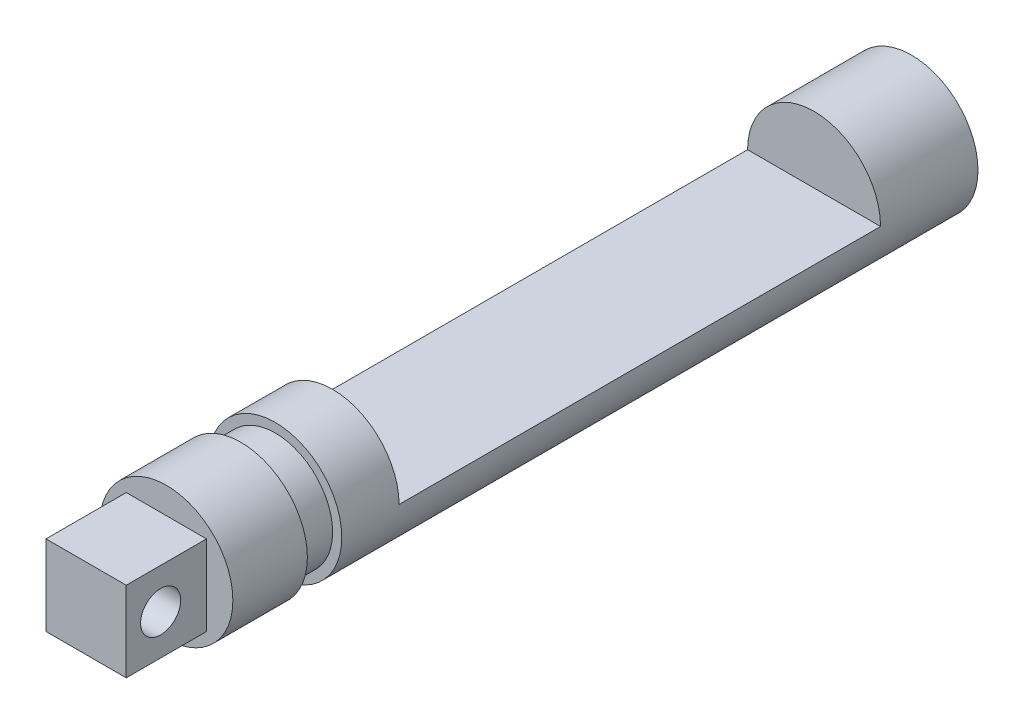
ISO-10303-21;
HEADER;
FILE_DESCRIPTION(('STEP AP214'),'2;1');
FILE_NAME('part.step','',(''),(''),'','','');
FILE_SCHEMA(('AUTOMOTIVE_DESIGN { 1 0 10303 214 1 1 1 1 }'));
ENDSEC;
DATA;
#1=APPLICATION_CONTEXT('core data for automotive mechanical design processes');
#2=APPLICATION_PROTOCOL_DEFINITION('international standard','automotive_design',2000,#1);
#3=PRODUCT_CONTEXT('',#1,'mechanical');
#4=PRODUCT('Part','Part','',(#3));
#5=PRODUCT_RELATED_PRODUCT_CATEGORY('part','',(#4));
#6=PRODUCT_DEFINITION_FORMATION('','',#4);
#7=PRODUCT_DEFINITION_CONTEXT('part definition',#1,'design');
#8=PRODUCT_DEFINITION('design','',#6,#7);
#9=PRODUCT_DEFINITION_SHAPE('','',#8);
#10=(LENGTH_UNIT() NAMED_UNIT(*) SI_UNIT(.MILLI.,.METRE.));
#11=(NAMED_UNIT(*) PLANE_ANGLE_UNIT() SI_UNIT($,.RADIAN.));
#12=(NAMED_UNIT(*) SI_UNIT($,.STERADIAN.) SOLID_ANGLE_UNIT());
#13=UNCERTAINTY_MEASURE_WITH_UNIT(LENGTH_MEASURE(1.E-05),#10,'distance_accuracy_value','');
#14=(GEOMETRIC_REPRESENTATION_CONTEXT(3) GLOBAL_UNCERTAINTY_ASSIGNED_CONTEXT((#13)) GLOBAL_UNIT_ASSIGNED_CONTEXT((#10,
#11,#12)) REPRESENTATION_CONTEXT('',''));
#15=CARTESIAN_POINT('',(0.,0.,0.));
#16=DIRECTION('',(0.,0.,1.));
#17=DIRECTION('',(1.,0.,0.));
#18=AXIS2_PLACEMENT_3D('',#15,#16,#17);
#19=CARTESIAN_POINT('',(0.,0.,32.5));
#20=DIRECTION('',(0.,0.,-1.));
#21=DIRECTION('',(-1.,0.,0.));
#22=AXIS2_PLACEMENT_3D('',#19,#20,#21);
#23=CYLINDRICAL_SURFACE('',#22,5.8);
#24=CARTESIAN_POINT('',(0.,0.,23.));
#25=DIRECTION('',(0.,0.,1.));
#26=DIRECTION('',(1.,0.,0.));
#27=AXIS2_PLACEMENT_3D('',#24,#25,#26);
#28=CIRCLE('',#27,5.8);
#29=CARTESIAN_POINT('',(5.8,0.,23.));
#30=VERTEX_POINT('',#29);
#31=EDGE_CURVE('E150',#30,#30,#28,.T.);
#32=ORIENTED_EDGE('',*,*,#31,.F.);
#33=EDGE_LOOP('',(#32));
#34=FACE_BOUND('',#33,.T.);
#35=CARTESIAN_POINT('',(0.,0.,-32.5));
#36=DIRECTION('',(0.,0.,1.));
#37=DIRECTION('',(1.,0.,0.));
#38=AXIS2_PLACEMENT_3D('',#35,#36,#37);
#39=CIRCLE('',#38,5.8);
#40=CARTESIAN_POINT('',(5.8,0.,-32.5));
#41=VERTEX_POINT('',#40);
#42=EDGE_CURVE('E43',#41,#41,#39,.T.);
#43=ORIENTED_EDGE('',*,*,#42,.T.);
#44=EDGE_LOOP('',(#43));
#45=FACE_BOUND('',#44,.T.);
#46=DIRECTION('',(0.,0.,1.));
#47=VECTOR('',#46,1.);
#48=CARTESIAN_POINT('',(5.8,0.,-24.));
#49=LINE('',#48,#47);
#50=CARTESIAN_POINT('',(5.8,0.,-24.));
#51=VERTEX_POINT('',#50);
#52=CARTESIAN_POINT('',(5.8,0.,18.));
#53=VERTEX_POINT('',#52);
#54=EDGE_CURVE('E101',#51,#53,#49,.T.);
#55=ORIENTED_EDGE('',*,*,#54,.T.);
#56=CARTESIAN_POINT('',(0.,0.,18.));
#57=DIRECTION('',(0.,0.,1.));
#58=DIRECTION('',(1.,0.,0.));
#59=AXIS2_PLACEMENT_3D('',#56,#57,#58);
#60=CIRCLE('',#59,5.8);
#61=CARTESIAN_POINT('',(-5.8,0.,18.));
#62=VERTEX_POINT('',#61);
#63=EDGE_CURVE('E105',#53,#62,#60,.T.);
#64=ORIENTED_EDGE('',*,*,#63,.T.);
#65=DIRECTION('',(0.,0.,1.));
#66=VECTOR('',#65,1.);
#67=CARTESIAN_POINT('',(-5.8,0.,-24.));
#68=LINE('',#67,#66);
#69=CARTESIAN_POINT('',(-5.8,0.,-24.));
#70=VERTEX_POINT('',#69);
#71=EDGE_CURVE('E91',#70,#62,#68,.T.);
#72=ORIENTED_EDGE('',*,*,#71,.F.);
#73=CARTESIAN_POINT('',(0.,0.,-24.));
#74=DIRECTION('',(0.,0.,1.));
#75=DIRECTION('',(1.,0.,0.));
#76=AXIS2_PLACEMENT_3D('',#73,#74,#75);
#77=CIRCLE('',#76,5.8);
#78=EDGE_CURVE('E153',#51,#70,#77,.T.);
#79=ORIENTED_EDGE('',*,*,#78,.F.);
#80=EDGE_LOOP('',(#55,#64,#72,#79));
#81=FACE_BOUND('',#80,.T.);
#82=ADVANCED_FACE('F39',(#34,#45,#81),#23,.T.);
#83=CARTESIAN_POINT('',(0.,0.,-32.5));
#84=DIRECTION('',(0.,0.,1.));
#85=DIRECTION('',(1.,0.,0.));
#86=AXIS2_PLACEMENT_3D('',#83,#84,#85);
#87=PLANE('',#86);
#88=ORIENTED_EDGE('',*,*,#42,.F.);
#89=EDGE_LOOP('',(#88));
#90=FACE_BOUND('',#89,.T.);
#91=ADVANCED_FACE('F162',(#90),#87,.F.);
#92=CARTESIAN_POINT('',(-5.8,0.,-24.));
#93=DIRECTION('',(0.,-1.,0.));
#94=DIRECTION('',(0.,0.,-1.));
#95=AXIS2_PLACEMENT_3D('',#92,#93,#94);
#96=PLANE('',#95);
#97=ORIENTED_EDGE('',*,*,#71,.T.);
#98=DIRECTION('',(1.,0.,0.));
#99=VECTOR('',#98,1.);
#100=CARTESIAN_POINT('',(-5.8,0.,18.));
#101=LINE('',#100,#99);
#102=EDGE_CURVE('E94',#62,#53,#101,.T.);
#103=ORIENTED_EDGE('',*,*,#102,.T.);
#104=ORIENTED_EDGE('',*,*,#54,.F.);
#105=DIRECTION('',(1.,0.,0.));
#106=VECTOR('',#105,1.);
#107=CARTESIAN_POINT('',(-5.8,0.,-24.));
#108=LINE('',#107,#106);
#109=EDGE_CURVE('E97',#70,#51,#108,.T.);
#110=ORIENTED_EDGE('',*,*,#109,.F.);
#111=EDGE_LOOP('',(#97,#103,#104,#110));
#112=FACE_BOUND('',#111,.T.);
#113=ADVANCED_FACE('F93',(#112),#96,.F.);
#114=CARTESIAN_POINT('',(0.,0.,-24.));
#115=DIRECTION('',(0.,0.,1.));
#116=DIRECTION('',(1.,0.,0.));
#117=AXIS2_PLACEMENT_3D('',#114,#115,#116);
#118=PLANE('',#117);
#119=ORIENTED_EDGE('',*,*,#78,.T.);
#120=ORIENTED_EDGE('',*,*,#109,.T.);
#121=EDGE_LOOP('',(#119,#120));
#122=FACE_BOUND('',#121,.T.);
#123=ADVANCED_FACE('F168',(#122),#118,.T.);
#124=CARTESIAN_POINT('',(0.,0.,23.));
#125=DIRECTION('',(0.,0.,1.));
#126=DIRECTION('',(1.,0.,0.));
#127=AXIS2_PLACEMENT_3D('',#124,#125,#126);
#128=PLANE('',#127);
#129=CARTESIAN_POINT('',(0.,0.,23.));
#130=DIRECTION('',(0.,0.,1.));
#131=DIRECTION('',(1.,0.,0.));
#132=AXIS2_PLACEMENT_3D('',#129,#130,#131);
#133=CIRCLE('',#132,5.);
#134=CARTESIAN_POINT('',(5.,0.,23.));
#135=VERTEX_POINT('',#134);
#136=EDGE_CURVE('E144',#135,#135,#133,.T.);
#137=ORIENTED_EDGE('',*,*,#136,.F.);
#138=EDGE_LOOP('',(#137));
#139=FACE_BOUND('',#138,.T.);
#140=ORIENTED_EDGE('',*,*,#31,.T.);
#141=EDGE_LOOP('',(#140));
#142=FACE_BOUND('',#141,.T.);
#143=ADVANCED_FACE('F178',(#139,#142),#128,.T.);
#144=CARTESIAN_POINT('',(0.,0.,26.));
#145=DIRECTION('',(0.,0.,1.));
#146=DIRECTION('',(1.,0.,0.));
#147=AXIS2_PLACEMENT_3D('',#144,#145,#146);
#148=PLANE('',#147);
#149=CARTESIAN_POINT('',(0.,0.,26.));
#150=DIRECTION('',(0.,0.,1.));
#151=DIRECTION('',(1.,0.,0.));
#152=AXIS2_PLACEMENT_3D('',#149,#150,#151);
#153=CIRCLE('',#152,5.);
#154=CARTESIAN_POINT('',(5.,0.,26.));
#155=VERTEX_POINT('',#154);
#156=EDGE_CURVE('E143',#155,#155,#153,.T.);
#157=ORIENTED_EDGE('',*,*,#156,.T.);
#158=EDGE_LOOP('',(#157));
#159=FACE_BOUND('',#158,.T.);
#160=CARTESIAN_POINT('',(0.,0.,26.));
#161=DIRECTION('',(0.,0.,1.));
#162=DIRECTION('',(1.,0.,0.));
#163=AXIS2_PLACEMENT_3D('',#160,#161,#162);
#164=CIRCLE('',#163,5.8);
#165=CARTESIAN_POINT('',(5.8,0.,26.));
#166=VERTEX_POINT('',#165);
#167=EDGE_CURVE('E147',#166,#166,#164,.T.);
#168=ORIENTED_EDGE('',*,*,#167,.F.);
#169=EDGE_LOOP('',(#168));
#170=FACE_BOUND('',#169,.T.);
#171=ADVANCED_FACE('F180',(#159,#170),#148,.F.);
#172=CARTESIAN_POINT('',(0.,0.,23.));
#173=DIRECTION('',(0.,0.,1.));
#174=DIRECTION('',(1.,0.,0.));
#175=AXIS2_PLACEMENT_3D('',#172,#173,#174);
#176=CYLINDRICAL_SURFACE('',#175,5.);
#177=ORIENTED_EDGE('',*,*,#136,.T.);
#178=EDGE_LOOP('',(#177));
#179=FACE_BOUND('',#178,.T.);
#180=ORIENTED_EDGE('',*,*,#156,.F.);
#181=EDGE_LOOP('',(#180));
#182=FACE_BOUND('',#181,.T.);
#183=ADVANCED_FACE('F174',(#179,#182),#176,.T.);
#184=CARTESIAN_POINT('',(0.,0.,32.5));
#185=DIRECTION('',(0.,0.,1.));
#186=DIRECTION('',(1.,0.,0.));
#187=AXIS2_PLACEMENT_3D('',#184,#185,#186);
#188=PLANE('',#187);
#189=DIRECTION('',(0.,1.,0.));
#190=VECTOR('',#189,1.);
#191=CARTESIAN_POINT('',(3.5,3.5,32.5));
#192=LINE('',#191,#190);
#193=CARTESIAN_POINT('',(3.5,-3.5,32.5));
#194=VERTEX_POINT('',#193);
#195=CARTESIAN_POINT('',(3.5,3.5,32.5));
#196=VERTEX_POINT('',#195);
#197=EDGE_CURVE('E54',#194,#196,#192,.T.);
#198=ORIENTED_EDGE('',*,*,#197,.F.);
#199=DIRECTION('',(1.,0.,0.));
#200=VECTOR('',#199,1.);
#201=CARTESIAN_POINT('',(-3.5,-3.5,32.5));
#202=LINE('',#201,#200);
#203=CARTESIAN_POINT('',(-3.5,-3.5,32.5));
#204=VERTEX_POINT('',#203);
#205=EDGE_CURVE('E58',#204,#194,#202,.T.);
#206=ORIENTED_EDGE('',*,*,#205,.F.);
#207=DIRECTION('',(0.,-1.,0.));
#208=VECTOR('',#207,1.);
#209=CARTESIAN_POINT('',(-3.5,3.5,32.5));
#210=LINE('',#209,#208);
#211=CARTESIAN_POINT('',(-3.5,3.5,32.5));
#212=VERTEX_POINT('',#211);
#213=EDGE_CURVE('E129',#212,#204,#210,.T.);
#214=ORIENTED_EDGE('',*,*,#213,.F.);
#215=DIRECTION('',(-1.,0.,0.));
#216=VECTOR('',#215,1.);
#217=CARTESIAN_POINT('',(-3.5,3.5,32.5));
#218=LINE('',#217,#216);
#219=EDGE_CURVE('E126',#196,#212,#218,.T.);
#220=ORIENTED_EDGE('',*,*,#219,.F.);
#221=EDGE_LOOP('',(#198,#206,#214,#220));
#222=FACE_BOUND('',#221,.T.);
#223=CARTESIAN_POINT('',(0.,0.,32.5));
#224=DIRECTION('',(0.,0.,1.));
#225=DIRECTION('',(1.,0.,0.));
#226=AXIS2_PLACEMENT_3D('',#223,#224,#225);
#227=CIRCLE('',#226,5.8);
#228=CARTESIAN_POINT('',(5.8,0.,32.5));
#229=VERTEX_POINT('',#228);
#230=EDGE_CURVE('E12',#229,#229,#227,.T.);
#231=ORIENTED_EDGE('',*,*,#230,.T.);
#232=EDGE_LOOP('',(#231));
#233=FACE_BOUND('',#232,.T.);
#234=ADVANCED_FACE('F172',(#222,#233),#188,.T.);
#235=ORIENTED_EDGE('',*,*,#167,.T.);
#236=EDGE_LOOP('',(#235));
#237=FACE_BOUND('',#236,.T.);
#238=ORIENTED_EDGE('',*,*,#230,.F.);
#239=EDGE_LOOP('',(#238));
#240=FACE_BOUND('',#239,.T.);
#241=ADVANCED_FACE('F41',(#237,#240),#23,.T.);
#242=CARTESIAN_POINT('',(3.5,3.5,39.5));
#243=DIRECTION('',(-1.,0.,0.));
#244=DIRECTION('',(0.,-1.,0.));
#245=AXIS2_PLACEMENT_3D('',#242,#243,#244);
#246=PLANE('',#245);
#247=CARTESIAN_POINT('',(3.5,0.,36.5));
#248=DIRECTION('',(-1.,0.,0.));
#249=DIRECTION('',(0.,-1.,0.));
#250=AXIS2_PLACEMENT_3D('',#247,#248,#249);
#251=CIRCLE('',#250,1.75);
#252=CARTESIAN_POINT('',(3.5,-1.75,36.5));
#253=VERTEX_POINT('',#252);
#254=EDGE_CURVE('E112',#253,#253,#251,.T.);
#255=ORIENTED_EDGE('',*,*,#254,.T.);
#256=EDGE_LOOP('',(#255));
#257=FACE_BOUND('',#256,.T.);
#258=ORIENTED_EDGE('',*,*,#197,.T.);
#259=DIRECTION('',(0.,0.,-1.));
#260=VECTOR('',#259,1.);
#261=CARTESIAN_POINT('',(3.5,3.5,39.5));
#262=LINE('',#261,#260);
#263=CARTESIAN_POINT('',(3.5,3.5,39.5));
#264=VERTEX_POINT('',#263);
#265=EDGE_CURVE('E140',#264,#196,#262,.T.);
#266=ORIENTED_EDGE('',*,*,#265,.F.);
#267=DIRECTION('',(0.,1.,0.));
#268=VECTOR('',#267,1.);
#269=CARTESIAN_POINT('',(3.5,3.5,39.5));
#270=LINE('',#269,#268);
#271=CARTESIAN_POINT('',(3.5,-3.5,39.5));
#272=VERTEX_POINT('',#271);
#273=EDGE_CURVE('E115',#272,#264,#270,.T.);
#274=ORIENTED_EDGE('',*,*,#273,.F.);
#275=DIRECTION('',(0.,0.,-1.));
#276=VECTOR('',#275,1.);
#277=CARTESIAN_POINT('',(3.5,-3.5,39.5));
#278=LINE('',#277,#276);
#279=EDGE_CURVE('E124',#272,#194,#278,.T.);
#280=ORIENTED_EDGE('',*,*,#279,.T.);
#281=EDGE_LOOP('',(#258,#266,#274,#280));
#282=FACE_BOUND('',#281,.T.);
#283=ADVANCED_FACE('F190',(#257,#282),#246,.F.);
#284=CARTESIAN_POINT('',(-3.5,3.5,39.5));
#285=DIRECTION('',(0.,-1.,0.));
#286=DIRECTION('',(0.,0.,-1.));
#287=AXIS2_PLACEMENT_3D('',#284,#285,#286);
#288=PLANE('',#287);
#289=ORIENTED_EDGE('',*,*,#219,.T.);
#290=DIRECTION('',(0.,0.,-1.));
#291=VECTOR('',#290,1.);
#292=CARTESIAN_POINT('',(-3.5,3.5,39.5));
#293=LINE('',#292,#291);
#294=CARTESIAN_POINT('',(-3.5,3.5,39.5));
#295=VERTEX_POINT('',#294);
#296=EDGE_CURVE('E137',#295,#212,#293,.T.);
#297=ORIENTED_EDGE('',*,*,#296,.F.);
#298=DIRECTION('',(-1.,0.,0.));
#299=VECTOR('',#298,1.);
#300=CARTESIAN_POINT('',(-3.5,3.5,39.5));
#301=LINE('',#300,#299);
#302=EDGE_CURVE('E118',#264,#295,#301,.T.);
#303=ORIENTED_EDGE('',*,*,#302,.F.);
#304=ORIENTED_EDGE('',*,*,#265,.T.);
#305=EDGE_LOOP('',(#289,#297,#303,#304));
#306=FACE_BOUND('',#305,.T.);
#307=ADVANCED_FACE('F193',(#306),#288,.F.);
#308=CARTESIAN_POINT('',(-3.5,3.5,39.5));
#309=DIRECTION('',(1.,0.,0.));
#310=DIRECTION('',(0.,1.,0.));
#311=AXIS2_PLACEMENT_3D('',#308,#309,#310);
#312=PLANE('',#311);
#313=CARTESIAN_POINT('',(-3.5,0.,36.5));
#314=DIRECTION('',(-1.,0.,0.));
#315=DIRECTION('',(0.,-1.,0.));
#316=AXIS2_PLACEMENT_3D('',#313,#314,#315);
#317=CIRCLE('',#316,1.75);
#318=CARTESIAN_POINT('',(-3.5,-1.75,36.5));
#319=VERTEX_POINT('',#318);
#320=EDGE_CURVE('E106',#319,#319,#317,.T.);
#321=ORIENTED_EDGE('',*,*,#320,.F.);
#322=EDGE_LOOP('',(#321));
#323=FACE_BOUND('',#322,.T.);
#324=ORIENTED_EDGE('',*,*,#213,.T.);
#325=DIRECTION('',(0.,0.,-1.));
#326=VECTOR('',#325,1.);
#327=CARTESIAN_POINT('',(-3.5,-3.5,39.5));
#328=LINE('',#327,#326);
#329=CARTESIAN_POINT('',(-3.5,-3.5,39.5));
#330=VERTEX_POINT('',#329);
#331=EDGE_CURVE('E134',#330,#204,#328,.T.);
#332=ORIENTED_EDGE('',*,*,#331,.F.);
#333=DIRECTION('',(0.,-1.,0.));
#334=VECTOR('',#333,1.);
#335=CARTESIAN_POINT('',(-3.5,3.5,39.5));
#336=LINE('',#335,#334);
#337=EDGE_CURVE('E120',#295,#330,#336,.T.);
#338=ORIENTED_EDGE('',*,*,#337,.F.);
#339=ORIENTED_EDGE('',*,*,#296,.T.);
#340=EDGE_LOOP('',(#324,#332,#338,#339));
#341=FACE_BOUND('',#340,.T.);
#342=ADVANCED_FACE('F197',(#323,#341),#312,.F.);
#343=CARTESIAN_POINT('',(-3.5,-3.5,39.5));
#344=DIRECTION('',(0.,1.,0.));
#345=DIRECTION('',(0.,0.,1.));
#346=AXIS2_PLACEMENT_3D('',#343,#344,#345);
#347=PLANE('',#346);
#348=ORIENTED_EDGE('',*,*,#205,.T.);
#349=ORIENTED_EDGE('',*,*,#279,.F.);
#350=DIRECTION('',(1.,0.,0.));
#351=VECTOR('',#350,1.);
#352=CARTESIAN_POINT('',(-3.5,-3.5,39.5));
#353=LINE('',#352,#351);
#354=EDGE_CURVE('E122',#330,#272,#353,.T.);
#355=ORIENTED_EDGE('',*,*,#354,.F.);
#356=ORIENTED_EDGE('',*,*,#331,.T.);
#357=EDGE_LOOP('',(#348,#349,#355,#356));
#358=FACE_BOUND('',#357,.T.);
#359=ADVANCED_FACE('F201',(#358),#347,.F.);
#360=CARTESIAN_POINT('',(0.,0.,39.5));
#361=DIRECTION('',(0.,0.,1.));
#362=DIRECTION('',(1.,0.,0.));
#363=AXIS2_PLACEMENT_3D('',#360,#361,#362);
#364=PLANE('',#363);
#365=ORIENTED_EDGE('',*,*,#273,.T.);
#366=ORIENTED_EDGE('',*,*,#302,.T.);
#367=ORIENTED_EDGE('',*,*,#337,.T.);
#368=ORIENTED_EDGE('',*,*,#354,.T.);
#369=EDGE_LOOP('',(#365,#366,#367,#368));
#370=FACE_BOUND('',#369,.T.);
#371=ADVANCED_FACE('F205',(#370),#364,.T.);
#372=CARTESIAN_POINT('',(5.8,0.,36.5));
#373=DIRECTION('',(-1.,0.,0.));
#374=DIRECTION('',(0.,-1.,0.));
#375=AXIS2_PLACEMENT_3D('',#372,#373,#374);
#376=CYLINDRICAL_SURFACE('',#375,1.75);
#377=ORIENTED_EDGE('',*,*,#320,.T.);
#378=EDGE_LOOP('',(#377));
#379=FACE_BOUND('',#378,.T.);
#380=ORIENTED_EDGE('',*,*,#254,.F.);
#381=EDGE_LOOP('',(#380));
#382=FACE_BOUND('',#381,.T.);
#383=ADVANCED_FACE('F209',(#379,#382),#376,.F.);
#384=CARTESIAN_POINT('',(0.,0.,18.));
#385=DIRECTION('',(0.,0.,1.));
#386=DIRECTION('',(1.,0.,0.));
#387=AXIS2_PLACEMENT_3D('',#384,#385,#386);
#388=PLANE('',#387);
#389=ORIENTED_EDGE('',*,*,#63,.F.);
#390=ORIENTED_EDGE('',*,*,#102,.F.);
#391=EDGE_LOOP('',(#389,#390));
#392=FACE_BOUND('',#391,.T.);
#393=ADVANCED_FACE('F104',(#392),#388,.F.);
#394=CLOSED_SHELL('',(#82,#91,#113,#123,#143,#171,#183,#234,#241,#283,#307,#342,#359,#371,#383,#393));
#395=MANIFOLD_SOLID_BREP('B2',#394);
#396=ADVANCED_BREP_SHAPE_REPRESENTATION('',(#18,#395),#14);
#397=SHAPE_DEFINITION_REPRESENTATION(#9,#396);
ENDSEC;
END-ISO-10303-21;
